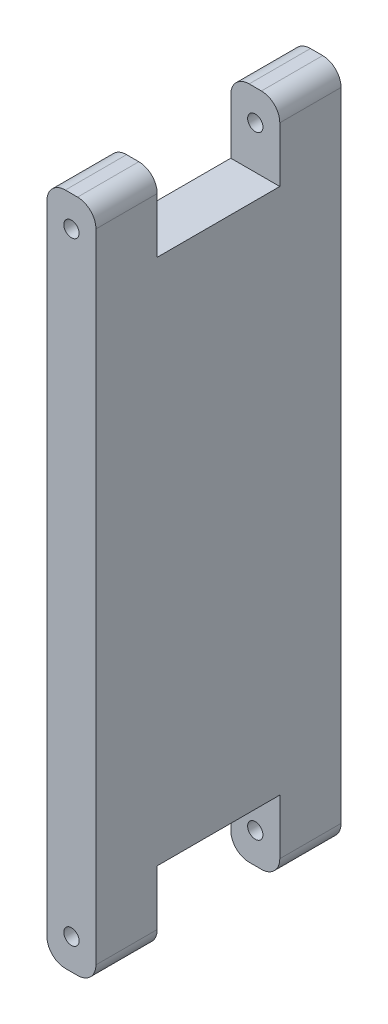
ISO-10303-21;
HEADER;
FILE_DESCRIPTION(('STEP AP214'),'2;1');
FILE_NAME('part.step','',(''),(''),'','','');
FILE_SCHEMA(('AUTOMOTIVE_DESIGN { 1 0 10303 214 1 1 1 1 }'));
ENDSEC;
DATA;
#1=APPLICATION_CONTEXT('core data for automotive mechanical design processes');
#2=APPLICATION_PROTOCOL_DEFINITION('international standard','automotive_design',2000,#1);
#3=PRODUCT_CONTEXT('',#1,'mechanical');
#4=PRODUCT('Part','Part','',(#3));
#5=PRODUCT_RELATED_PRODUCT_CATEGORY('part','',(#4));
#6=PRODUCT_DEFINITION_FORMATION('','',#4);
#7=PRODUCT_DEFINITION_CONTEXT('part definition',#1,'design');
#8=PRODUCT_DEFINITION('design','',#6,#7);
#9=PRODUCT_DEFINITION_SHAPE('','',#8);
#10=(LENGTH_UNIT() NAMED_UNIT(*) SI_UNIT(.MILLI.,.METRE.));
#11=(NAMED_UNIT(*) PLANE_ANGLE_UNIT() SI_UNIT($,.RADIAN.));
#12=(NAMED_UNIT(*) SI_UNIT($,.STERADIAN.) SOLID_ANGLE_UNIT());
#13=UNCERTAINTY_MEASURE_WITH_UNIT(LENGTH_MEASURE(1.E-05),#10,'distance_accuracy_value','');
#14=(GEOMETRIC_REPRESENTATION_CONTEXT(3) GLOBAL_UNCERTAINTY_ASSIGNED_CONTEXT((#13)) GLOBAL_UNIT_ASSIGNED_CONTEXT((#10,
#11,#12)) REPRESENTATION_CONTEXT('',''));
#15=CARTESIAN_POINT('',(0.,0.,0.));
#16=DIRECTION('',(0.,0.,1.));
#17=DIRECTION('',(1.,0.,0.));
#18=AXIS2_PLACEMENT_3D('',#15,#16,#17);
#19=CARTESIAN_POINT('',(-3.99999999999999,-55.,-40.));
#20=DIRECTION('',(0.,-1.,0.));
#21=DIRECTION('',(0.,0.,-1.));
#22=AXIS2_PLACEMENT_3D('',#19,#20,#21);
#23=PLANE('',#22);
#24=DIRECTION('',(1.,0.,0.));
#25=VECTOR('',#24,1.);
#26=CARTESIAN_POINT('',(-3.99999999999999,-55.,0.));
#27=LINE('',#26,#25);
#28=CARTESIAN_POINT('',(-0.999999999999994,-55.,0.));
#29=VERTEX_POINT('',#28);
#30=CARTESIAN_POINT('',(1.00000000000001,-55.,0.));
#31=VERTEX_POINT('',#30);
#32=EDGE_CURVE('E241',#29,#31,#27,.T.);
#33=ORIENTED_EDGE('',*,*,#32,.F.);
#34=DIRECTION('',(0.,0.,1.));
#35=VECTOR('',#34,1.);
#36=CARTESIAN_POINT('',(-0.999999999999994,-55.,-40.));
#37=LINE('',#36,#35);
#38=CARTESIAN_POINT('',(-0.999999999999994,-55.,-10.));
#39=VERTEX_POINT('',#38);
#40=EDGE_CURVE('E314',#29,#39,#37,.F.);
#41=ORIENTED_EDGE('',*,*,#40,.T.);
#42=DIRECTION('',(-1.,0.,0.));
#43=VECTOR('',#42,1.);
#44=CARTESIAN_POINT('',(-3.99999999999999,-55.,-10.));
#45=LINE('',#44,#43);
#46=CARTESIAN_POINT('',(1.00000000000001,-55.,-10.));
#47=VERTEX_POINT('',#46);
#48=EDGE_CURVE('E233',#47,#39,#45,.T.);
#49=ORIENTED_EDGE('',*,*,#48,.F.);
#50=DIRECTION('',(0.,0.,1.));
#51=VECTOR('',#50,1.);
#52=CARTESIAN_POINT('',(1.00000000000001,-55.,-40.));
#53=LINE('',#52,#51);
#54=EDGE_CURVE('E311',#47,#31,#53,.T.);
#55=ORIENTED_EDGE('',*,*,#54,.T.);
#56=EDGE_LOOP('',(#33,#41,#49,#55));
#57=FACE_BOUND('',#56,.T.);
#58=ADVANCED_FACE('F37',(#57),#23,.T.);
#59=CARTESIAN_POINT('',(-4.00000000000001,55.,-40.));
#60=DIRECTION('',(0.,1.,0.));
#61=DIRECTION('',(0.,0.,1.));
#62=AXIS2_PLACEMENT_3D('',#59,#60,#61);
#63=PLANE('',#62);
#64=DIRECTION('',(-1.,0.,0.));
#65=VECTOR('',#64,1.);
#66=CARTESIAN_POINT('',(-4.00000000000001,55.,-40.));
#67=LINE('',#66,#65);
#68=CARTESIAN_POINT('',(0.999999999999995,55.,-40.));
#69=VERTEX_POINT('',#68);
#70=CARTESIAN_POINT('',(-1.00000000000001,55.,-40.));
#71=VERTEX_POINT('',#70);
#72=EDGE_CURVE('E240',#69,#71,#67,.T.);
#73=ORIENTED_EDGE('',*,*,#72,.T.);
#74=DIRECTION('',(0.,0.,1.));
#75=VECTOR('',#74,1.);
#76=CARTESIAN_POINT('',(-1.00000000000001,55.,-40.));
#77=LINE('',#76,#75);
#78=CARTESIAN_POINT('',(-1.00000000000001,55.,-30.));
#79=VERTEX_POINT('',#78);
#80=EDGE_CURVE('E331',#71,#79,#77,.T.);
#81=ORIENTED_EDGE('',*,*,#80,.T.);
#82=DIRECTION('',(-1.,0.,0.));
#83=VECTOR('',#82,1.);
#84=CARTESIAN_POINT('',(-4.00000000000001,55.,-30.));
#85=LINE('',#84,#83);
#86=CARTESIAN_POINT('',(0.999999999999995,55.,-30.));
#87=VERTEX_POINT('',#86);
#88=EDGE_CURVE('E262',#87,#79,#85,.T.);
#89=ORIENTED_EDGE('',*,*,#88,.F.);
#90=DIRECTION('',(0.,0.,1.));
#91=VECTOR('',#90,1.);
#92=CARTESIAN_POINT('',(0.999999999999995,55.,-40.));
#93=LINE('',#92,#91);
#94=EDGE_CURVE('E329',#87,#69,#93,.F.);
#95=ORIENTED_EDGE('',*,*,#94,.T.);
#96=EDGE_LOOP('',(#73,#81,#89,#95));
#97=FACE_BOUND('',#96,.T.);
#98=ADVANCED_FACE('F365',(#97),#63,.T.);
#99=CARTESIAN_POINT('',(3.99999999999999,55.,-40.));
#100=DIRECTION('',(1.,0.,0.));
#101=DIRECTION('',(0.,1.,0.));
#102=AXIS2_PLACEMENT_3D('',#99,#100,#101);
#103=PLANE('',#102);
#104=DIRECTION('',(0.,1.,0.));
#105=VECTOR('',#104,1.);
#106=CARTESIAN_POINT('',(4.00000000000001,-67.,-30.));
#107=LINE('',#106,#105);
#108=CARTESIAN_POINT('',(4.00000000000001,-52.,-30.));
#109=VERTEX_POINT('',#108);
#110=CARTESIAN_POINT('',(4.00000000000001,-43.,-30.));
#111=VERTEX_POINT('',#110);
#112=EDGE_CURVE('E222',#109,#111,#107,.T.);
#113=ORIENTED_EDGE('',*,*,#112,.F.);
#114=DIRECTION('',(0.,0.,1.));
#115=VECTOR('',#114,1.);
#116=CARTESIAN_POINT('',(4.00000000000001,-52.,-40.));
#117=LINE('',#116,#115);
#118=CARTESIAN_POINT('',(4.00000000000001,-52.,-40.));
#119=VERTEX_POINT('',#118);
#120=EDGE_CURVE('E301',#109,#119,#117,.F.);
#121=ORIENTED_EDGE('',*,*,#120,.T.);
#122=DIRECTION('',(0.,1.,0.));
#123=VECTOR('',#122,1.);
#124=CARTESIAN_POINT('',(3.99999999999999,55.,-40.));
#125=LINE('',#124,#123);
#126=CARTESIAN_POINT('',(3.99999999999999,52.,-40.));
#127=VERTEX_POINT('',#126);
#128=EDGE_CURVE('E237',#119,#127,#125,.T.);
#129=ORIENTED_EDGE('',*,*,#128,.T.);
#130=DIRECTION('',(0.,0.,1.));
#131=VECTOR('',#130,1.);
#132=CARTESIAN_POINT('',(3.99999999999999,52.,-40.));
#133=LINE('',#132,#131);
#134=CARTESIAN_POINT('',(3.99999999999999,52.,-30.));
#135=VERTEX_POINT('',#134);
#136=EDGE_CURVE('E296',#127,#135,#133,.T.);
#137=ORIENTED_EDGE('',*,*,#136,.T.);
#138=DIRECTION('',(0.,1.,0.));
#139=VECTOR('',#138,1.);
#140=CARTESIAN_POINT('',(3.99999999999999,67.,-30.));
#141=LINE('',#140,#139);
#142=CARTESIAN_POINT('',(3.99999999999999,43.,-30.));
#143=VERTEX_POINT('',#142);
#144=EDGE_CURVE('E204',#143,#135,#141,.T.);
#145=ORIENTED_EDGE('',*,*,#144,.F.);
#146=DIRECTION('',(0.,0.,-1.));
#147=VECTOR('',#146,1.);
#148=CARTESIAN_POINT('',(3.99999999999999,43.,-10.));
#149=LINE('',#148,#147);
#150=CARTESIAN_POINT('',(3.99999999999999,43.,-10.));
#151=VERTEX_POINT('',#150);
#152=EDGE_CURVE('E208',#151,#143,#149,.T.);
#153=ORIENTED_EDGE('',*,*,#152,.F.);
#154=DIRECTION('',(0.,-1.,0.));
#155=VECTOR('',#154,1.);
#156=CARTESIAN_POINT('',(3.99999999999999,67.,-10.));
#157=LINE('',#156,#155);
#158=CARTESIAN_POINT('',(3.99999999999999,52.,-10.));
#159=VERTEX_POINT('',#158);
#160=EDGE_CURVE('E193',#159,#151,#157,.T.);
#161=ORIENTED_EDGE('',*,*,#160,.F.);
#162=DIRECTION('',(0.,0.,1.));
#163=VECTOR('',#162,1.);
#164=CARTESIAN_POINT('',(3.99999999999999,52.,-40.));
#165=LINE('',#164,#163);
#166=CARTESIAN_POINT('',(3.99999999999999,52.,0.));
#167=VERTEX_POINT('',#166);
#168=EDGE_CURVE('E293',#159,#167,#165,.T.);
#169=ORIENTED_EDGE('',*,*,#168,.T.);
#170=DIRECTION('',(0.,1.,0.));
#171=VECTOR('',#170,1.);
#172=CARTESIAN_POINT('',(3.99999999999999,55.,0.));
#173=LINE('',#172,#171);
#174=CARTESIAN_POINT('',(4.00000000000001,-52.,0.));
#175=VERTEX_POINT('',#174);
#176=EDGE_CURVE('E236',#175,#167,#173,.T.);
#177=ORIENTED_EDGE('',*,*,#176,.F.);
#178=DIRECTION('',(0.,0.,1.));
#179=VECTOR('',#178,1.);
#180=CARTESIAN_POINT('',(4.00000000000001,-52.,-40.));
#181=LINE('',#180,#179);
#182=CARTESIAN_POINT('',(4.00000000000001,-52.,-10.));
#183=VERTEX_POINT('',#182);
#184=EDGE_CURVE('E299',#175,#183,#181,.F.);
#185=ORIENTED_EDGE('',*,*,#184,.T.);
#186=DIRECTION('',(0.,-1.,0.));
#187=VECTOR('',#186,1.);
#188=CARTESIAN_POINT('',(4.00000000000001,-67.,-10.));
#189=LINE('',#188,#187);
#190=CARTESIAN_POINT('',(4.00000000000001,-43.,-10.));
#191=VERTEX_POINT('',#190);
#192=EDGE_CURVE('E206',#191,#183,#189,.T.);
#193=ORIENTED_EDGE('',*,*,#192,.F.);
#194=DIRECTION('',(0.,0.,1.));
#195=VECTOR('',#194,1.);
#196=CARTESIAN_POINT('',(4.00000000000001,-43.,-10.));
#197=LINE('',#196,#195);
#198=EDGE_CURVE('E219',#111,#191,#197,.T.);
#199=ORIENTED_EDGE('',*,*,#198,.F.);
#200=EDGE_LOOP('',(#113,#121,#129,#137,#145,#153,#161,#169,#177,#185,#193,#199));
#201=FACE_BOUND('',#200,.T.);
#202=ADVANCED_FACE('F374',(#201),#103,.T.);
#203=DIRECTION('',(1.,0.,0.));
#204=VECTOR('',#203,1.);
#205=CARTESIAN_POINT('',(-3.99999999999999,-55.,-30.));
#206=LINE('',#205,#204);
#207=CARTESIAN_POINT('',(-0.999999999999994,-55.,-30.));
#208=VERTEX_POINT('',#207);
#209=CARTESIAN_POINT('',(1.00000000000001,-55.,-30.));
#210=VERTEX_POINT('',#209);
#211=EDGE_CURVE('E210',#208,#210,#206,.T.);
#212=ORIENTED_EDGE('',*,*,#211,.F.);
#213=DIRECTION('',(0.,0.,1.));
#214=VECTOR('',#213,1.);
#215=CARTESIAN_POINT('',(-0.999999999999994,-55.,-40.));
#216=LINE('',#215,#214);
#217=CARTESIAN_POINT('',(-0.999999999999994,-55.,-40.));
#218=VERTEX_POINT('',#217);
#219=EDGE_CURVE('E283',#208,#218,#216,.F.);
#220=ORIENTED_EDGE('',*,*,#219,.T.);
#221=DIRECTION('',(1.,0.,0.));
#222=VECTOR('',#221,1.);
#223=CARTESIAN_POINT('',(-3.99999999999999,-55.,-40.));
#224=LINE('',#223,#222);
#225=CARTESIAN_POINT('',(1.00000000000001,-55.,-40.));
#226=VERTEX_POINT('',#225);
#227=EDGE_CURVE('E246',#218,#226,#224,.T.);
#228=ORIENTED_EDGE('',*,*,#227,.T.);
#229=DIRECTION('',(0.,0.,1.));
#230=VECTOR('',#229,1.);
#231=CARTESIAN_POINT('',(1.00000000000001,-55.,-40.));
#232=LINE('',#231,#230);
#233=EDGE_CURVE('E280',#226,#210,#232,.T.);
#234=ORIENTED_EDGE('',*,*,#233,.T.);
#235=EDGE_LOOP('',(#212,#220,#228,#234));
#236=FACE_BOUND('',#235,.T.);
#237=ADVANCED_FACE('F384',(#236),#23,.T.);
#238=CARTESIAN_POINT('',(-4.00000000000001,55.,-40.));
#239=DIRECTION('',(-1.,0.,0.));
#240=DIRECTION('',(0.,-1.,0.));
#241=AXIS2_PLACEMENT_3D('',#238,#239,#240);
#242=PLANE('',#241);
#243=DIRECTION('',(0.,-1.,0.));
#244=VECTOR('',#243,1.);
#245=CARTESIAN_POINT('',(-4.00000000000001,55.,-40.));
#246=LINE('',#245,#244);
#247=CARTESIAN_POINT('',(-4.00000000000001,52.,-40.));
#248=VERTEX_POINT('',#247);
#249=CARTESIAN_POINT('',(-3.99999999999999,-52.,-40.));
#250=VERTEX_POINT('',#249);
#251=EDGE_CURVE('E244',#248,#250,#246,.T.);
#252=ORIENTED_EDGE('',*,*,#251,.T.);
#253=DIRECTION('',(0.,0.,1.));
#254=VECTOR('',#253,1.);
#255=CARTESIAN_POINT('',(-3.99999999999999,-52.,-40.));
#256=LINE('',#255,#254);
#257=CARTESIAN_POINT('',(-3.99999999999999,-52.,-30.));
#258=VERTEX_POINT('',#257);
#259=EDGE_CURVE('E273',#250,#258,#256,.T.);
#260=ORIENTED_EDGE('',*,*,#259,.T.);
#261=DIRECTION('',(0.,-1.,0.));
#262=VECTOR('',#261,1.);
#263=CARTESIAN_POINT('',(-4.00000000000001,55.,-30.));
#264=LINE('',#263,#262);
#265=CARTESIAN_POINT('',(-3.99999999999999,-43.,-30.));
#266=VERTEX_POINT('',#265);
#267=EDGE_CURVE('E264',#266,#258,#264,.T.);
#268=ORIENTED_EDGE('',*,*,#267,.F.);
#269=DIRECTION('',(0.,0.,1.));
#270=VECTOR('',#269,1.);
#271=CARTESIAN_POINT('',(-4.00000000000001,-43.,-10.));
#272=LINE('',#271,#270);
#273=CARTESIAN_POINT('',(-4.00000000000001,-43.,-10.));
#274=VERTEX_POINT('',#273);
#275=EDGE_CURVE('E215',#266,#274,#272,.T.);
#276=ORIENTED_EDGE('',*,*,#275,.T.);
#277=DIRECTION('',(0.,-1.,0.));
#278=VECTOR('',#277,1.);
#279=CARTESIAN_POINT('',(-4.,-67.,-10.));
#280=LINE('',#279,#278);
#281=CARTESIAN_POINT('',(-4.00000000000001,-52.,-10.));
#282=VERTEX_POINT('',#281);
#283=EDGE_CURVE('E223',#274,#282,#280,.T.);
#284=ORIENTED_EDGE('',*,*,#283,.T.);
#285=DIRECTION('',(0.,0.,1.));
#286=VECTOR('',#285,1.);
#287=CARTESIAN_POINT('',(-3.99999999999999,-52.,-40.));
#288=LINE('',#287,#286);
#289=CARTESIAN_POINT('',(-3.99999999999999,-52.,0.));
#290=VERTEX_POINT('',#289);
#291=EDGE_CURVE('E270',#282,#290,#288,.T.);
#292=ORIENTED_EDGE('',*,*,#291,.T.);
#293=DIRECTION('',(0.,-1.,0.));
#294=VECTOR('',#293,1.);
#295=CARTESIAN_POINT('',(-4.00000000000001,55.,0.));
#296=LINE('',#295,#294);
#297=CARTESIAN_POINT('',(-4.00000000000001,52.,0.));
#298=VERTEX_POINT('',#297);
#299=EDGE_CURVE('E255',#298,#290,#296,.T.);
#300=ORIENTED_EDGE('',*,*,#299,.F.);
#301=DIRECTION('',(0.,0.,1.));
#302=VECTOR('',#301,1.);
#303=CARTESIAN_POINT('',(-4.00000000000001,52.,-40.));
#304=LINE('',#303,#302);
#305=CARTESIAN_POINT('',(-4.00000000000002,52.,-10.));
#306=VERTEX_POINT('',#305);
#307=EDGE_CURVE('E184',#298,#306,#304,.F.);
#308=ORIENTED_EDGE('',*,*,#307,.T.);
#309=DIRECTION('',(0.,-1.,0.));
#310=VECTOR('',#309,1.);
#311=CARTESIAN_POINT('',(-4.00000000000002,67.,-10.));
#312=LINE('',#311,#310);
#313=CARTESIAN_POINT('',(-4.00000000000002,43.,-10.));
#314=VERTEX_POINT('',#313);
#315=EDGE_CURVE('E175',#306,#314,#312,.T.);
#316=ORIENTED_EDGE('',*,*,#315,.T.);
#317=DIRECTION('',(0.,0.,-1.));
#318=VECTOR('',#317,1.);
#319=CARTESIAN_POINT('',(-4.00000000000002,43.,-10.));
#320=LINE('',#319,#318);
#321=CARTESIAN_POINT('',(-4.00000000000002,43.,-30.));
#322=VERTEX_POINT('',#321);
#323=EDGE_CURVE('E181',#314,#322,#320,.T.);
#324=ORIENTED_EDGE('',*,*,#323,.T.);
#325=DIRECTION('',(0.,1.,0.));
#326=VECTOR('',#325,1.);
#327=CARTESIAN_POINT('',(-4.00000000000002,67.,-30.));
#328=LINE('',#327,#326);
#329=CARTESIAN_POINT('',(-4.00000000000002,52.,-30.));
#330=VERTEX_POINT('',#329);
#331=EDGE_CURVE('E187',#322,#330,#328,.T.);
#332=ORIENTED_EDGE('',*,*,#331,.T.);
#333=DIRECTION('',(0.,0.,1.));
#334=VECTOR('',#333,1.);
#335=CARTESIAN_POINT('',(-4.00000000000001,52.,-40.));
#336=LINE('',#335,#334);
#337=EDGE_CURVE('E267',#330,#248,#336,.F.);
#338=ORIENTED_EDGE('',*,*,#337,.T.);
#339=EDGE_LOOP('',(#252,#260,#268,#276,#284,#292,#300,#308,#316,#324,#332,#338));
#340=FACE_BOUND('',#339,.T.);
#341=ADVANCED_FACE('F178',(#340),#242,.T.);
#342=DIRECTION('',(1.,0.,0.));
#343=VECTOR('',#342,1.);
#344=CARTESIAN_POINT('',(-4.00000000000001,55.,-10.));
#345=LINE('',#344,#343);
#346=CARTESIAN_POINT('',(-1.00000000000001,55.,-10.));
#347=VERTEX_POINT('',#346);
#348=CARTESIAN_POINT('',(0.999999999999995,55.,-10.));
#349=VERTEX_POINT('',#348);
#350=EDGE_CURVE('E249',#347,#349,#345,.T.);
#351=ORIENTED_EDGE('',*,*,#350,.F.);
#352=DIRECTION('',(0.,0.,1.));
#353=VECTOR('',#352,1.);
#354=CARTESIAN_POINT('',(-1.00000000000001,55.,-40.));
#355=LINE('',#354,#353);
#356=CARTESIAN_POINT('',(-1.00000000000001,55.,0.));
#357=VERTEX_POINT('',#356);
#358=EDGE_CURVE('E322',#347,#357,#355,.T.);
#359=ORIENTED_EDGE('',*,*,#358,.T.);
#360=DIRECTION('',(-1.,0.,0.));
#361=VECTOR('',#360,1.);
#362=CARTESIAN_POINT('',(-4.00000000000001,55.,0.));
#363=LINE('',#362,#361);
#364=CARTESIAN_POINT('',(0.999999999999995,55.,0.));
#365=VERTEX_POINT('',#364);
#366=EDGE_CURVE('E252',#365,#357,#363,.T.);
#367=ORIENTED_EDGE('',*,*,#366,.F.);
#368=DIRECTION('',(0.,0.,1.));
#369=VECTOR('',#368,1.);
#370=CARTESIAN_POINT('',(0.999999999999995,55.,-40.));
#371=LINE('',#370,#369);
#372=EDGE_CURVE('E320',#365,#349,#371,.F.);
#373=ORIENTED_EDGE('',*,*,#372,.T.);
#374=EDGE_LOOP('',(#351,#359,#367,#373));
#375=FACE_BOUND('',#374,.T.);
#376=ADVANCED_FACE('F421',(#375),#63,.T.);
#377=CARTESIAN_POINT('',(0.,0.,-40.));
#378=DIRECTION('',(0.,0.,1.));
#379=DIRECTION('',(1.,0.,0.));
#380=AXIS2_PLACEMENT_3D('',#377,#378,#379);
#381=PLANE('',#380);
#382=CARTESIAN_POINT('',(0.,50.,-40.));
#383=DIRECTION('',(0.,0.,1.));
#384=DIRECTION('',(1.,0.,0.));
#385=AXIS2_PLACEMENT_3D('',#382,#383,#384);
#386=CIRCLE('',#385,1.25);
#387=CARTESIAN_POINT('',(1.25,50.,-40.));
#388=VERTEX_POINT('',#387);
#389=EDGE_CURVE('E336',#388,#388,#386,.T.);
#390=ORIENTED_EDGE('',*,*,#389,.T.);
#391=EDGE_LOOP('',(#390));
#392=FACE_BOUND('',#391,.T.);
#393=CARTESIAN_POINT('',(0.,-50.,-40.));
#394=DIRECTION('',(0.,0.,1.));
#395=DIRECTION('',(-1.,0.,0.));
#396=AXIS2_PLACEMENT_3D('',#393,#394,#395);
#397=CIRCLE('',#396,1.25);
#398=CARTESIAN_POINT('',(-1.25,-50.,-40.));
#399=VERTEX_POINT('',#398);
#400=EDGE_CURVE('E352',#399,#399,#397,.T.);
#401=ORIENTED_EDGE('',*,*,#400,.T.);
#402=EDGE_LOOP('',(#401));
#403=FACE_BOUND('',#402,.T.);
#404=ORIENTED_EDGE('',*,*,#227,.F.);
#405=CARTESIAN_POINT('',(-0.999999999999994,-52.,-40.));
#406=DIRECTION('',(0.,0.,1.));
#407=DIRECTION('',(1.,0.,0.));
#408=AXIS2_PLACEMENT_3D('',#405,#406,#407);
#409=CIRCLE('',#408,3.);
#410=EDGE_CURVE('E291',#218,#250,#409,.F.);
#411=ORIENTED_EDGE('',*,*,#410,.T.);
#412=ORIENTED_EDGE('',*,*,#251,.F.);
#413=CARTESIAN_POINT('',(-1.00000000000001,52.,-40.));
#414=DIRECTION('',(0.,0.,1.));
#415=DIRECTION('',(1.,0.,0.));
#416=AXIS2_PLACEMENT_3D('',#413,#414,#415);
#417=CIRCLE('',#416,3.);
#418=EDGE_CURVE('E287',#248,#71,#417,.F.);
#419=ORIENTED_EDGE('',*,*,#418,.T.);
#420=ORIENTED_EDGE('',*,*,#72,.F.);
#421=CARTESIAN_POINT('',(0.999999999999994,52.,-40.));
#422=DIRECTION('',(0.,0.,1.));
#423=DIRECTION('',(1.,0.,0.));
#424=AXIS2_PLACEMENT_3D('',#421,#422,#423);
#425=CIRCLE('',#424,3.);
#426=EDGE_CURVE('E285',#69,#127,#425,.F.);
#427=ORIENTED_EDGE('',*,*,#426,.T.);
#428=ORIENTED_EDGE('',*,*,#128,.F.);
#429=CARTESIAN_POINT('',(1.00000000000001,-52.,-40.));
#430=DIRECTION('',(0.,0.,1.));
#431=DIRECTION('',(1.,0.,0.));
#432=AXIS2_PLACEMENT_3D('',#429,#430,#431);
#433=CIRCLE('',#432,3.);
#434=EDGE_CURVE('E289',#119,#226,#433,.F.);
#435=ORIENTED_EDGE('',*,*,#434,.T.);
#436=EDGE_LOOP('',(#404,#411,#412,#419,#420,#427,#428,#435));
#437=FACE_BOUND('',#436,.T.);
#438=ADVANCED_FACE('F362',(#392,#403,#437),#381,.F.);
#439=CARTESIAN_POINT('',(0.,0.,0.));
#440=DIRECTION('',(0.,0.,1.));
#441=DIRECTION('',(1.,0.,0.));
#442=AXIS2_PLACEMENT_3D('',#439,#440,#441);
#443=PLANE('',#442);
#444=CARTESIAN_POINT('',(0.,50.,0.));
#445=DIRECTION('',(0.,0.,1.));
#446=DIRECTION('',(1.,0.,0.));
#447=AXIS2_PLACEMENT_3D('',#444,#445,#446);
#448=CIRCLE('',#447,1.25);
#449=CARTESIAN_POINT('',(1.25,50.,0.));
#450=VERTEX_POINT('',#449);
#451=EDGE_CURVE('E342',#450,#450,#448,.T.);
#452=ORIENTED_EDGE('',*,*,#451,.F.);
#453=EDGE_LOOP('',(#452));
#454=FACE_BOUND('',#453,.T.);
#455=CARTESIAN_POINT('',(0.,-50.,0.));
#456=DIRECTION('',(0.,0.,1.));
#457=DIRECTION('',(-1.,0.,0.));
#458=AXIS2_PLACEMENT_3D('',#455,#456,#457);
#459=CIRCLE('',#458,1.25);
#460=CARTESIAN_POINT('',(-1.25,-50.,0.));
#461=VERTEX_POINT('',#460);
#462=EDGE_CURVE('E347',#461,#461,#459,.T.);
#463=ORIENTED_EDGE('',*,*,#462,.F.);
#464=EDGE_LOOP('',(#463));
#465=FACE_BOUND('',#464,.T.);
#466=ORIENTED_EDGE('',*,*,#299,.T.);
#467=CARTESIAN_POINT('',(-0.999999999999994,-52.,0.));
#468=DIRECTION('',(0.,0.,1.));
#469=DIRECTION('',(1.,0.,0.));
#470=AXIS2_PLACEMENT_3D('',#467,#468,#469);
#471=CIRCLE('',#470,3.);
#472=EDGE_CURVE('E309',#290,#29,#471,.T.);
#473=ORIENTED_EDGE('',*,*,#472,.T.);
#474=ORIENTED_EDGE('',*,*,#32,.T.);
#475=CARTESIAN_POINT('',(1.00000000000001,-52.,0.));
#476=DIRECTION('',(0.,0.,1.));
#477=DIRECTION('',(1.,0.,0.));
#478=AXIS2_PLACEMENT_3D('',#475,#476,#477);
#479=CIRCLE('',#478,3.);
#480=EDGE_CURVE('E307',#31,#175,#479,.T.);
#481=ORIENTED_EDGE('',*,*,#480,.T.);
#482=ORIENTED_EDGE('',*,*,#176,.T.);
#483=CARTESIAN_POINT('',(0.999999999999994,52.,0.));
#484=DIRECTION('',(0.,0.,1.));
#485=DIRECTION('',(1.,0.,0.));
#486=AXIS2_PLACEMENT_3D('',#483,#484,#485);
#487=CIRCLE('',#486,3.);
#488=EDGE_CURVE('E303',#167,#365,#487,.T.);
#489=ORIENTED_EDGE('',*,*,#488,.T.);
#490=ORIENTED_EDGE('',*,*,#366,.T.);
#491=CARTESIAN_POINT('',(-1.00000000000001,52.,0.));
#492=DIRECTION('',(0.,0.,1.));
#493=DIRECTION('',(1.,0.,0.));
#494=AXIS2_PLACEMENT_3D('',#491,#492,#493);
#495=CIRCLE('',#494,3.);
#496=EDGE_CURVE('E305',#357,#298,#495,.T.);
#497=ORIENTED_EDGE('',*,*,#496,.T.);
#498=EDGE_LOOP('',(#466,#473,#474,#481,#482,#489,#490,#497));
#499=FACE_BOUND('',#498,.T.);
#500=ADVANCED_FACE('F410',(#454,#465,#499),#443,.T.);
#501=CARTESIAN_POINT('',(-4.00000000000002,67.,-30.));
#502=DIRECTION('',(0.,0.,-1.));
#503=DIRECTION('',(-1.,0.,0.));
#504=AXIS2_PLACEMENT_3D('',#501,#502,#503);
#505=PLANE('',#504);
#506=CARTESIAN_POINT('',(0.,50.,-30.));
#507=DIRECTION('',(0.,0.,-1.));
#508=DIRECTION('',(-1.,0.,0.));
#509=AXIS2_PLACEMENT_3D('',#506,#507,#508);
#510=CIRCLE('',#509,1.25);
#511=CARTESIAN_POINT('',(-1.25,50.,-30.));
#512=VERTEX_POINT('',#511);
#513=EDGE_CURVE('E218',#512,#512,#510,.T.);
#514=ORIENTED_EDGE('',*,*,#513,.T.);
#515=EDGE_LOOP('',(#514));
#516=FACE_BOUND('',#515,.T.);
#517=ORIENTED_EDGE('',*,*,#88,.T.);
#518=CARTESIAN_POINT('',(-1.00000000000001,52.,-30.));
#519=DIRECTION('',(0.,0.,-1.));
#520=DIRECTION('',(-1.,0.,0.));
#521=AXIS2_PLACEMENT_3D('',#518,#519,#520);
#522=CIRCLE('',#521,3.);
#523=EDGE_CURVE('E11',#79,#330,#522,.F.);
#524=ORIENTED_EDGE('',*,*,#523,.T.);
#525=ORIENTED_EDGE('',*,*,#331,.F.);
#526=DIRECTION('',(1.,0.,0.));
#527=VECTOR('',#526,1.);
#528=CARTESIAN_POINT('',(-4.00000000000002,43.,-30.));
#529=LINE('',#528,#527);
#530=EDGE_CURVE('E197',#322,#143,#529,.T.);
#531=ORIENTED_EDGE('',*,*,#530,.T.);
#532=ORIENTED_EDGE('',*,*,#144,.T.);
#533=CARTESIAN_POINT('',(0.999999999999994,52.,-30.));
#534=DIRECTION('',(0.,0.,-1.));
#535=DIRECTION('',(-1.,0.,0.));
#536=AXIS2_PLACEMENT_3D('',#533,#534,#535);
#537=CIRCLE('',#536,3.);
#538=EDGE_CURVE('E46',#135,#87,#537,.F.);
#539=ORIENTED_EDGE('',*,*,#538,.T.);
#540=EDGE_LOOP('',(#517,#524,#525,#531,#532,#539));
#541=FACE_BOUND('',#540,.T.);
#542=ADVANCED_FACE('F426',(#516,#541),#505,.F.);
#543=CARTESIAN_POINT('',(-4.00000000000002,43.,-10.));
#544=DIRECTION('',(0.,-1.,0.));
#545=DIRECTION('',(1.,0.,0.));
#546=AXIS2_PLACEMENT_3D('',#543,#544,#545);
#547=PLANE('',#546);
#548=ORIENTED_EDGE('',*,*,#152,.T.);
#549=ORIENTED_EDGE('',*,*,#530,.F.);
#550=ORIENTED_EDGE('',*,*,#323,.F.);
#551=DIRECTION('',(1.,0.,0.));
#552=VECTOR('',#551,1.);
#553=CARTESIAN_POINT('',(-4.00000000000002,43.,-10.));
#554=LINE('',#553,#552);
#555=EDGE_CURVE('E190',#314,#151,#554,.T.);
#556=ORIENTED_EDGE('',*,*,#555,.T.);
#557=EDGE_LOOP('',(#548,#549,#550,#556));
#558=FACE_BOUND('',#557,.T.);
#559=ADVANCED_FACE('F199',(#558),#547,.F.);
#560=CARTESIAN_POINT('',(-4.00000000000002,67.,-10.));
#561=DIRECTION('',(0.,0.,1.));
#562=DIRECTION('',(1.,0.,0.));
#563=AXIS2_PLACEMENT_3D('',#560,#561,#562);
#564=PLANE('',#563);
#565=CARTESIAN_POINT('',(0.,50.,-10.));
#566=DIRECTION('',(0.,0.,1.));
#567=DIRECTION('',(1.,0.,0.));
#568=AXIS2_PLACEMENT_3D('',#565,#566,#567);
#569=CIRCLE('',#568,1.25);
#570=CARTESIAN_POINT('',(1.25,50.,-10.));
#571=VERTEX_POINT('',#570);
#572=EDGE_CURVE('E41',#571,#571,#569,.T.);
#573=ORIENTED_EDGE('',*,*,#572,.T.);
#574=EDGE_LOOP('',(#573));
#575=FACE_BOUND('',#574,.T.);
#576=ORIENTED_EDGE('',*,*,#315,.F.);
#577=CARTESIAN_POINT('',(-1.00000000000001,52.,-10.));
#578=DIRECTION('',(0.,0.,1.));
#579=DIRECTION('',(1.,0.,0.));
#580=AXIS2_PLACEMENT_3D('',#577,#578,#579);
#581=CIRCLE('',#580,3.);
#582=EDGE_CURVE('E327',#306,#347,#581,.F.);
#583=ORIENTED_EDGE('',*,*,#582,.T.);
#584=ORIENTED_EDGE('',*,*,#350,.T.);
#585=CARTESIAN_POINT('',(0.999999999999994,52.,-10.));
#586=DIRECTION('',(0.,0.,1.));
#587=DIRECTION('',(1.,0.,0.));
#588=AXIS2_PLACEMENT_3D('',#585,#586,#587);
#589=CIRCLE('',#588,3.);
#590=EDGE_CURVE('E325',#349,#159,#589,.F.);
#591=ORIENTED_EDGE('',*,*,#590,.T.);
#592=ORIENTED_EDGE('',*,*,#160,.T.);
#593=ORIENTED_EDGE('',*,*,#555,.F.);
#594=EDGE_LOOP('',(#576,#583,#584,#591,#592,#593));
#595=FACE_BOUND('',#594,.T.);
#596=ADVANCED_FACE('F191',(#575,#595),#564,.F.);
#597=CARTESIAN_POINT('',(-4.,-67.,-10.));
#598=DIRECTION('',(0.,0.,1.));
#599=DIRECTION('',(1.,0.,0.));
#600=AXIS2_PLACEMENT_3D('',#597,#598,#599);
#601=PLANE('',#600);
#602=CARTESIAN_POINT('',(0.,-50.,-10.));
#603=DIRECTION('',(0.,0.,1.));
#604=DIRECTION('',(1.,0.,0.));
#605=AXIS2_PLACEMENT_3D('',#602,#603,#604);
#606=CIRCLE('',#605,1.25);
#607=CARTESIAN_POINT('',(1.25,-50.,-10.));
#608=VERTEX_POINT('',#607);
#609=EDGE_CURVE('E335',#608,#608,#606,.T.);
#610=ORIENTED_EDGE('',*,*,#609,.T.);
#611=EDGE_LOOP('',(#610));
#612=FACE_BOUND('',#611,.T.);
#613=ORIENTED_EDGE('',*,*,#48,.T.);
#614=CARTESIAN_POINT('',(-0.999999999999994,-52.,-10.));
#615=DIRECTION('',(0.,0.,1.));
#616=DIRECTION('',(1.,0.,0.));
#617=AXIS2_PLACEMENT_3D('',#614,#615,#616);
#618=CIRCLE('',#617,3.);
#619=EDGE_CURVE('E318',#39,#282,#618,.F.);
#620=ORIENTED_EDGE('',*,*,#619,.T.);
#621=ORIENTED_EDGE('',*,*,#283,.F.);
#622=DIRECTION('',(1.,0.,0.));
#623=VECTOR('',#622,1.);
#624=CARTESIAN_POINT('',(-4.00000000000001,-43.,-10.));
#625=LINE('',#624,#623);
#626=EDGE_CURVE('E216',#274,#191,#625,.T.);
#627=ORIENTED_EDGE('',*,*,#626,.T.);
#628=ORIENTED_EDGE('',*,*,#192,.T.);
#629=CARTESIAN_POINT('',(1.00000000000001,-52.,-10.));
#630=DIRECTION('',(0.,0.,1.));
#631=DIRECTION('',(1.,0.,0.));
#632=AXIS2_PLACEMENT_3D('',#629,#630,#631);
#633=CIRCLE('',#632,3.);
#634=EDGE_CURVE('E316',#183,#47,#633,.F.);
#635=ORIENTED_EDGE('',*,*,#634,.T.);
#636=EDGE_LOOP('',(#613,#620,#621,#627,#628,#635));
#637=FACE_BOUND('',#636,.T.);
#638=ADVANCED_FACE('F400',(#612,#637),#601,.F.);
#639=CARTESIAN_POINT('',(-4.00000000000001,-43.,-10.));
#640=DIRECTION('',(0.,1.,0.));
#641=DIRECTION('',(-1.,0.,0.));
#642=AXIS2_PLACEMENT_3D('',#639,#640,#641);
#643=PLANE('',#642);
#644=ORIENTED_EDGE('',*,*,#198,.T.);
#645=ORIENTED_EDGE('',*,*,#626,.F.);
#646=ORIENTED_EDGE('',*,*,#275,.F.);
#647=DIRECTION('',(1.,0.,0.));
#648=VECTOR('',#647,1.);
#649=CARTESIAN_POINT('',(-4.00000000000001,-43.,-30.));
#650=LINE('',#649,#648);
#651=EDGE_CURVE('E212',#266,#111,#650,.T.);
#652=ORIENTED_EDGE('',*,*,#651,.T.);
#653=EDGE_LOOP('',(#644,#645,#646,#652));
#654=FACE_BOUND('',#653,.T.);
#655=ADVANCED_FACE('F394',(#654),#643,.F.);
#656=CARTESIAN_POINT('',(-4.,-67.,-30.));
#657=DIRECTION('',(0.,0.,-1.));
#658=DIRECTION('',(-1.,0.,0.));
#659=AXIS2_PLACEMENT_3D('',#656,#657,#658);
#660=PLANE('',#659);
#661=CARTESIAN_POINT('',(0.,-50.,-30.));
#662=DIRECTION('',(0.,0.,-1.));
#663=DIRECTION('',(-1.,0.,0.));
#664=AXIS2_PLACEMENT_3D('',#661,#662,#663);
#665=CIRCLE('',#664,1.25);
#666=CARTESIAN_POINT('',(-1.25,-50.,-30.));
#667=VERTEX_POINT('',#666);
#668=EDGE_CURVE('E333',#667,#667,#665,.T.);
#669=ORIENTED_EDGE('',*,*,#668,.T.);
#670=EDGE_LOOP('',(#669));
#671=FACE_BOUND('',#670,.T.);
#672=ORIENTED_EDGE('',*,*,#267,.T.);
#673=CARTESIAN_POINT('',(-0.999999999999994,-52.,-30.));
#674=DIRECTION('',(0.,0.,-1.));
#675=DIRECTION('',(-1.,0.,0.));
#676=AXIS2_PLACEMENT_3D('',#673,#674,#675);
#677=CIRCLE('',#676,3.);
#678=EDGE_CURVE('E278',#258,#208,#677,.F.);
#679=ORIENTED_EDGE('',*,*,#678,.T.);
#680=ORIENTED_EDGE('',*,*,#211,.T.);
#681=CARTESIAN_POINT('',(1.00000000000001,-52.,-30.));
#682=DIRECTION('',(0.,0.,-1.));
#683=DIRECTION('',(-1.,0.,0.));
#684=AXIS2_PLACEMENT_3D('',#681,#682,#683);
#685=CIRCLE('',#684,3.);
#686=EDGE_CURVE('E276',#210,#109,#685,.F.);
#687=ORIENTED_EDGE('',*,*,#686,.T.);
#688=ORIENTED_EDGE('',*,*,#112,.T.);
#689=ORIENTED_EDGE('',*,*,#651,.F.);
#690=EDGE_LOOP('',(#672,#679,#680,#687,#688,#689));
#691=FACE_BOUND('',#690,.T.);
#692=ADVANCED_FACE('F392',(#671,#691),#660,.F.);
#693=CARTESIAN_POINT('',(-0.999999999999994,-52.,-40.));
#694=DIRECTION('',(0.,0.,1.));
#695=DIRECTION('',(1.,0.,0.));
#696=AXIS2_PLACEMENT_3D('',#693,#694,#695);
#697=CYLINDRICAL_SURFACE('',#696,3.);
#698=ORIENTED_EDGE('',*,*,#410,.F.);
#699=ORIENTED_EDGE('',*,*,#219,.F.);
#700=ORIENTED_EDGE('',*,*,#678,.F.);
#701=ORIENTED_EDGE('',*,*,#259,.F.);
#702=EDGE_LOOP('',(#698,#699,#700,#701));
#703=FACE_BOUND('',#702,.T.);
#704=ADVANCED_FACE('F387',(#703),#697,.T.);
#705=CARTESIAN_POINT('',(1.00000000000001,-52.,-40.));
#706=DIRECTION('',(0.,0.,1.));
#707=DIRECTION('',(1.,0.,0.));
#708=AXIS2_PLACEMENT_3D('',#705,#706,#707);
#709=CYLINDRICAL_SURFACE('',#708,3.);
#710=ORIENTED_EDGE('',*,*,#434,.F.);
#711=ORIENTED_EDGE('',*,*,#120,.F.);
#712=ORIENTED_EDGE('',*,*,#686,.F.);
#713=ORIENTED_EDGE('',*,*,#233,.F.);
#714=EDGE_LOOP('',(#710,#711,#712,#713));
#715=FACE_BOUND('',#714,.T.);
#716=ADVANCED_FACE('F379',(#715),#709,.T.);
#717=CARTESIAN_POINT('',(-0.999999999999994,-52.,-40.));
#718=DIRECTION('',(0.,0.,1.));
#719=DIRECTION('',(1.,0.,0.));
#720=AXIS2_PLACEMENT_3D('',#717,#718,#719);
#721=CYLINDRICAL_SURFACE('',#720,3.);
#722=ORIENTED_EDGE('',*,*,#619,.F.);
#723=ORIENTED_EDGE('',*,*,#40,.F.);
#724=ORIENTED_EDGE('',*,*,#472,.F.);
#725=ORIENTED_EDGE('',*,*,#291,.F.);
#726=EDGE_LOOP('',(#722,#723,#724,#725));
#727=FACE_BOUND('',#726,.T.);
#728=ADVANCED_FACE('F414',(#727),#721,.T.);
#729=CARTESIAN_POINT('',(1.00000000000001,-52.,-40.));
#730=DIRECTION('',(0.,0.,1.));
#731=DIRECTION('',(1.,0.,0.));
#732=AXIS2_PLACEMENT_3D('',#729,#730,#731);
#733=CYLINDRICAL_SURFACE('',#732,3.);
#734=ORIENTED_EDGE('',*,*,#634,.F.);
#735=ORIENTED_EDGE('',*,*,#184,.F.);
#736=ORIENTED_EDGE('',*,*,#480,.F.);
#737=ORIENTED_EDGE('',*,*,#54,.F.);
#738=EDGE_LOOP('',(#734,#735,#736,#737));
#739=FACE_BOUND('',#738,.T.);
#740=ADVANCED_FACE('F405',(#739),#733,.T.);
#741=CARTESIAN_POINT('',(-1.00000000000001,52.,-40.));
#742=DIRECTION('',(0.,0.,1.));
#743=DIRECTION('',(1.,0.,0.));
#744=AXIS2_PLACEMENT_3D('',#741,#742,#743);
#745=CYLINDRICAL_SURFACE('',#744,3.);
#746=ORIENTED_EDGE('',*,*,#582,.F.);
#747=ORIENTED_EDGE('',*,*,#307,.F.);
#748=ORIENTED_EDGE('',*,*,#496,.F.);
#749=ORIENTED_EDGE('',*,*,#358,.F.);
#750=EDGE_LOOP('',(#746,#747,#748,#749));
#751=FACE_BOUND('',#750,.T.);
#752=ADVANCED_FACE('F416',(#751),#745,.T.);
#753=CARTESIAN_POINT('',(-1.00000000000001,52.,-40.));
#754=DIRECTION('',(0.,0.,1.));
#755=DIRECTION('',(1.,0.,0.));
#756=AXIS2_PLACEMENT_3D('',#753,#754,#755);
#757=CYLINDRICAL_SURFACE('',#756,3.);
#758=ORIENTED_EDGE('',*,*,#418,.F.);
#759=ORIENTED_EDGE('',*,*,#337,.F.);
#760=ORIENTED_EDGE('',*,*,#523,.F.);
#761=ORIENTED_EDGE('',*,*,#80,.F.);
#762=EDGE_LOOP('',(#758,#759,#760,#761));
#763=FACE_BOUND('',#762,.T.);
#764=ADVANCED_FACE('F358',(#763),#757,.T.);
#765=CARTESIAN_POINT('',(0.999999999999994,52.,-40.));
#766=DIRECTION('',(0.,0.,1.));
#767=DIRECTION('',(1.,0.,0.));
#768=AXIS2_PLACEMENT_3D('',#765,#766,#767);
#769=CYLINDRICAL_SURFACE('',#768,3.);
#770=ORIENTED_EDGE('',*,*,#426,.F.);
#771=ORIENTED_EDGE('',*,*,#94,.F.);
#772=ORIENTED_EDGE('',*,*,#538,.F.);
#773=ORIENTED_EDGE('',*,*,#136,.F.);
#774=EDGE_LOOP('',(#770,#771,#772,#773));
#775=FACE_BOUND('',#774,.T.);
#776=ADVANCED_FACE('F368',(#775),#769,.T.);
#777=CARTESIAN_POINT('',(0.999999999999994,52.,-40.));
#778=DIRECTION('',(0.,0.,1.));
#779=DIRECTION('',(1.,0.,0.));
#780=AXIS2_PLACEMENT_3D('',#777,#778,#779);
#781=CYLINDRICAL_SURFACE('',#780,3.);
#782=ORIENTED_EDGE('',*,*,#590,.F.);
#783=ORIENTED_EDGE('',*,*,#372,.F.);
#784=ORIENTED_EDGE('',*,*,#488,.F.);
#785=ORIENTED_EDGE('',*,*,#168,.F.);
#786=EDGE_LOOP('',(#782,#783,#784,#785));
#787=FACE_BOUND('',#786,.T.);
#788=ADVANCED_FACE('F39',(#787),#781,.T.);
#789=CARTESIAN_POINT('',(0.,-50.,-40.));
#790=DIRECTION('',(0.,0.,1.));
#791=DIRECTION('',(1.,0.,0.));
#792=AXIS2_PLACEMENT_3D('',#789,#790,#791);
#793=CYLINDRICAL_SURFACE('',#792,1.25);
#794=ORIENTED_EDGE('',*,*,#400,.F.);
#795=EDGE_LOOP('',(#794));
#796=FACE_BOUND('',#795,.T.);
#797=ORIENTED_EDGE('',*,*,#668,.F.);
#798=EDGE_LOOP('',(#797));
#799=FACE_BOUND('',#798,.T.);
#800=ADVANCED_FACE('F470',(#796,#799),#793,.F.);
#801=ORIENTED_EDGE('',*,*,#462,.T.);
#802=EDGE_LOOP('',(#801));
#803=FACE_BOUND('',#802,.T.);
#804=ORIENTED_EDGE('',*,*,#609,.F.);
#805=EDGE_LOOP('',(#804));
#806=FACE_BOUND('',#805,.T.);
#807=ADVANCED_FACE('F474',(#803,#806),#793,.F.);
#808=CARTESIAN_POINT('',(0.,50.,-40.));
#809=DIRECTION('',(0.,0.,1.));
#810=DIRECTION('',(1.,0.,0.));
#811=AXIS2_PLACEMENT_3D('',#808,#809,#810);
#812=CYLINDRICAL_SURFACE('',#811,1.25);
#813=ORIENTED_EDGE('',*,*,#451,.T.);
#814=EDGE_LOOP('',(#813));
#815=FACE_BOUND('',#814,.T.);
#816=ORIENTED_EDGE('',*,*,#572,.F.);
#817=EDGE_LOOP('',(#816));
#818=FACE_BOUND('',#817,.T.);
#819=ADVANCED_FACE('F480',(#815,#818),#812,.F.);
#820=ORIENTED_EDGE('',*,*,#389,.F.);
#821=EDGE_LOOP('',(#820));
#822=FACE_BOUND('',#821,.T.);
#823=ORIENTED_EDGE('',*,*,#513,.F.);
#824=EDGE_LOOP('',(#823));
#825=FACE_BOUND('',#824,.T.);
#826=ADVANCED_FACE('F485',(#822,#825),#812,.F.);
#827=CLOSED_SHELL('',(#58,#98,#202,#237,#341,#376,#438,#500,#542,#559,#596,#638,#655,#692,#704,
#716,#728,#740,#752,#764,#776,#788,#800,#807,#819,#826));
#828=MANIFOLD_SOLID_BREP('B2',#827);
#829=ADVANCED_BREP_SHAPE_REPRESENTATION('',(#18,#828),#14);
#830=SHAPE_DEFINITION_REPRESENTATION(#9,#829);
ENDSEC;
END-ISO-10303-21;
